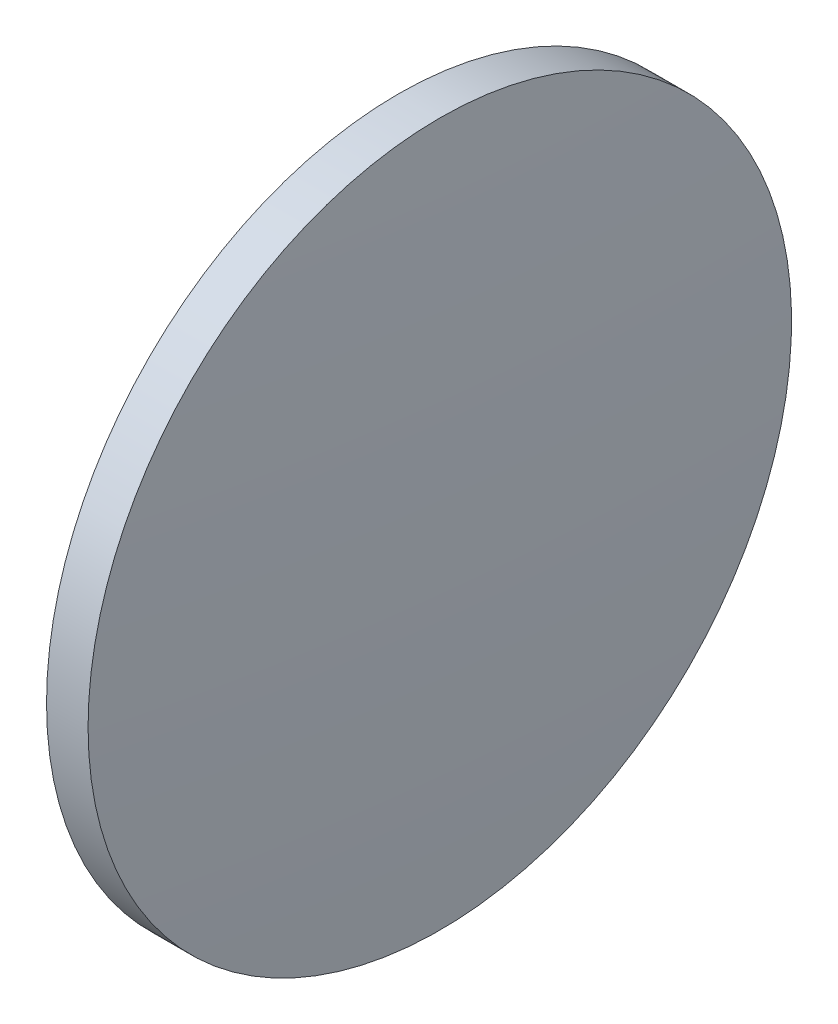
ISO-10303-21;
HEADER;
FILE_DESCRIPTION(('STEP AP214'),'2;1');
FILE_NAME('part.step','',(''),(''),'','','');
FILE_SCHEMA(('AUTOMOTIVE_DESIGN { 1 0 10303 214 1 1 1 1 }'));
ENDSEC;
DATA;
#1=APPLICATION_CONTEXT('core data for automotive mechanical design processes');
#2=APPLICATION_PROTOCOL_DEFINITION('international standard','automotive_design',2000,#1);
#3=PRODUCT_CONTEXT('',#1,'mechanical');
#4=PRODUCT('Part','Part','',(#3));
#5=PRODUCT_RELATED_PRODUCT_CATEGORY('part','',(#4));
#6=PRODUCT_DEFINITION_FORMATION('','',#4);
#7=PRODUCT_DEFINITION_CONTEXT('part definition',#1,'design');
#8=PRODUCT_DEFINITION('design','',#6,#7);
#9=PRODUCT_DEFINITION_SHAPE('','',#8);
#10=(LENGTH_UNIT() NAMED_UNIT(*) SI_UNIT(.MILLI.,.METRE.));
#11=(NAMED_UNIT(*) PLANE_ANGLE_UNIT() SI_UNIT($,.RADIAN.));
#12=(NAMED_UNIT(*) SI_UNIT($,.STERADIAN.) SOLID_ANGLE_UNIT());
#13=UNCERTAINTY_MEASURE_WITH_UNIT(LENGTH_MEASURE(1.E-05),#10,'distance_accuracy_value','');
#14=(GEOMETRIC_REPRESENTATION_CONTEXT(3) GLOBAL_UNCERTAINTY_ASSIGNED_CONTEXT((#13)) GLOBAL_UNIT_ASSIGNED_CONTEXT((#10,
#11,#12)) REPRESENTATION_CONTEXT('',''));
#15=CARTESIAN_POINT('',(0.,0.,0.));
#16=DIRECTION('',(0.,0.,1.));
#17=DIRECTION('',(1.,0.,0.));
#18=AXIS2_PLACEMENT_3D('',#15,#16,#17);
#19=CARTESIAN_POINT('',(631.883949745953,97.2322260463689,0.));
#20=DIRECTION('',(-1.,0.,0.));
#21=DIRECTION('',(0.,1.,0.));
#22=AXIS2_PLACEMENT_3D('',#19,#20,#21);
#23=SPHERICAL_SURFACE('',#22,461.167557796628);
#24=CARTESIAN_POINT('',(171.416408692182,97.2322260463696,0.));
#25=DIRECTION('',(-1.,0.,0.));
#26=DIRECTION('',(0.,0.,1.));
#27=AXIS2_PLACEMENT_3D('',#24,#25,#26);
#28=CIRCLE('',#27,25.4);
#29=CARTESIAN_POINT('',(171.416408692182,97.2322260463696,25.4));
#30=VERTEX_POINT('',#29);
#31=EDGE_CURVE('E41',#30,#30,#28,.T.);
#32=ORIENTED_EDGE('',*,*,#31,.T.);
#33=EDGE_LOOP('',(#32));
#34=FACE_BOUND('',#33,.T.);
#35=ADVANCED_FACE('F35',(#34),#23,.T.);
#36=CARTESIAN_POINT('',(-286.051174647309,97.2322260463688,0.));
#37=DIRECTION('',(-1.,0.,0.));
#38=DIRECTION('',(0.,1.,0.));
#39=AXIS2_PLACEMENT_3D('',#36,#37,#38);
#40=SPHERICAL_SURFACE('',#39,461.167557796634);
#41=CARTESIAN_POINT('',(174.416366406468,97.2322260463696,0.));
#42=DIRECTION('',(-1.,0.,0.));
#43=DIRECTION('',(0.,0.,1.));
#44=AXIS2_PLACEMENT_3D('',#41,#42,#43);
#45=CIRCLE('',#44,25.4);
#46=CARTESIAN_POINT('',(174.416366406468,97.2322260463696,25.4));
#47=VERTEX_POINT('',#46);
#48=EDGE_CURVE('E10',#47,#47,#45,.T.);
#49=ORIENTED_EDGE('',*,*,#48,.F.);
#50=EDGE_LOOP('',(#49));
#51=FACE_BOUND('',#50,.T.);
#52=ADVANCED_FACE('F50',(#51),#40,.T.);
#53=CARTESIAN_POINT('',(165.744107942151,97.2322260463696,0.));
#54=DIRECTION('',(-1.,0.,0.));
#55=DIRECTION('',(0.,0.,1.));
#56=AXIS2_PLACEMENT_3D('',#53,#54,#55);
#57=CYLINDRICAL_SURFACE('',#56,25.4);
#58=ORIENTED_EDGE('',*,*,#48,.T.);
#59=EDGE_LOOP('',(#58));
#60=FACE_BOUND('',#59,.T.);
#61=ORIENTED_EDGE('',*,*,#31,.F.);
#62=EDGE_LOOP('',(#61));
#63=FACE_BOUND('',#62,.T.);
#64=ADVANCED_FACE('F48',(#60,#63),#57,.T.);
#65=CLOSED_SHELL('',(#35,#52,#64));
#66=MANIFOLD_SOLID_BREP('B2',#65);
#67=ADVANCED_BREP_SHAPE_REPRESENTATION('',(#18,#66),#14);
#68=SHAPE_DEFINITION_REPRESENTATION(#9,#67);
ENDSEC;
END-ISO-10303-21;
